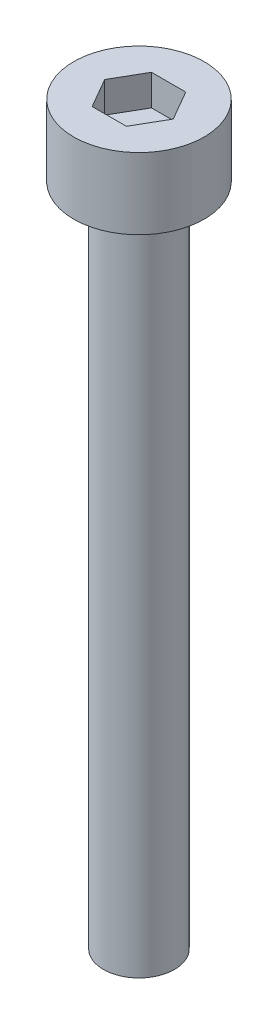
ISO-10303-21;
HEADER;
FILE_DESCRIPTION(('STEP AP214'),'2;1');
FILE_NAME('part.step','',(''),(''),'','','');
FILE_SCHEMA(('AUTOMOTIVE_DESIGN { 1 0 10303 214 1 1 1 1 }'));
ENDSEC;
DATA;
#1=APPLICATION_CONTEXT('core data for automotive mechanical design processes');
#2=APPLICATION_PROTOCOL_DEFINITION('international standard','automotive_design',2000,#1);
#3=PRODUCT_CONTEXT('',#1,'mechanical');
#4=PRODUCT('Part','Part','',(#3));
#5=PRODUCT_RELATED_PRODUCT_CATEGORY('part','',(#4));
#6=PRODUCT_DEFINITION_FORMATION('','',#4);
#7=PRODUCT_DEFINITION_CONTEXT('part definition',#1,'design');
#8=PRODUCT_DEFINITION('design','',#6,#7);
#9=PRODUCT_DEFINITION_SHAPE('','',#8);
#10=(LENGTH_UNIT() NAMED_UNIT(*) SI_UNIT(.MILLI.,.METRE.));
#11=(NAMED_UNIT(*) PLANE_ANGLE_UNIT() SI_UNIT($,.RADIAN.));
#12=(NAMED_UNIT(*) SI_UNIT($,.STERADIAN.) SOLID_ANGLE_UNIT());
#13=UNCERTAINTY_MEASURE_WITH_UNIT(LENGTH_MEASURE(1.E-05),#10,'distance_accuracy_value','');
#14=(GEOMETRIC_REPRESENTATION_CONTEXT(3) GLOBAL_UNCERTAINTY_ASSIGNED_CONTEXT((#13)) GLOBAL_UNIT_ASSIGNED_CONTEXT((#10,
#11,#12)) REPRESENTATION_CONTEXT('',''));
#15=CARTESIAN_POINT('',(0.,0.,0.));
#16=DIRECTION('',(0.,0.,1.));
#17=DIRECTION('',(1.,0.,0.));
#18=AXIS2_PLACEMENT_3D('',#15,#16,#17);
#19=CARTESIAN_POINT('',(0.,3.,0.));
#20=DIRECTION('',(0.,-1.,0.));
#21=DIRECTION('',(0.,0.,-1.));
#22=AXIS2_PLACEMENT_3D('',#19,#20,#21);
#23=CYLINDRICAL_SURFACE('',#22,2.75);
#24=CARTESIAN_POINT('',(0.,3.,0.));
#25=DIRECTION('',(0.,1.,0.));
#26=DIRECTION('',(0.,0.,1.));
#27=AXIS2_PLACEMENT_3D('',#24,#25,#26);
#28=CIRCLE('',#27,2.75);
#29=CARTESIAN_POINT('',(0.,3.,2.75));
#30=VERTEX_POINT('',#29);
#31=EDGE_CURVE('E45',#30,#30,#28,.T.);
#32=ORIENTED_EDGE('',*,*,#31,.F.);
#33=EDGE_LOOP('',(#32));
#34=FACE_BOUND('',#33,.T.);
#35=CARTESIAN_POINT('',(0.,0.,0.));
#36=DIRECTION('',(0.,1.,0.));
#37=DIRECTION('',(0.,0.,1.));
#38=AXIS2_PLACEMENT_3D('',#35,#36,#37);
#39=CIRCLE('',#38,2.75);
#40=CARTESIAN_POINT('',(0.,0.,2.75));
#41=VERTEX_POINT('',#40);
#42=EDGE_CURVE('E40',#41,#41,#39,.T.);
#43=ORIENTED_EDGE('',*,*,#42,.T.);
#44=EDGE_LOOP('',(#43));
#45=FACE_BOUND('',#44,.T.);
#46=ADVANCED_FACE('F37',(#34,#45),#23,.T.);
#47=CARTESIAN_POINT('',(0.,3.,0.));
#48=DIRECTION('',(0.,1.,0.));
#49=DIRECTION('',(0.,0.,1.));
#50=AXIS2_PLACEMENT_3D('',#47,#48,#49);
#51=PLANE('',#50);
#52=DIRECTION('',(0.5,0.,-0.866025403784439));
#53=VECTOR('',#52,1.);
#54=CARTESIAN_POINT('',(0.721687836487032,3.,1.25));
#55=LINE('',#54,#53);
#56=CARTESIAN_POINT('',(0.721687836487032,3.,1.25));
#57=VERTEX_POINT('',#56);
#58=CARTESIAN_POINT('',(1.44337567297406,3.,0.));
#59=VERTEX_POINT('',#58);
#60=EDGE_CURVE('E53',#57,#59,#55,.T.);
#61=ORIENTED_EDGE('',*,*,#60,.F.);
#62=DIRECTION('',(1.,0.,0.));
#63=VECTOR('',#62,1.);
#64=CARTESIAN_POINT('',(-0.721687836487033,3.,1.25));
#65=LINE('',#64,#63);
#66=CARTESIAN_POINT('',(-0.721687836487033,3.,1.25));
#67=VERTEX_POINT('',#66);
#68=EDGE_CURVE('E137',#67,#57,#65,.T.);
#69=ORIENTED_EDGE('',*,*,#68,.F.);
#70=DIRECTION('',(0.5,0.,0.866025403784439));
#71=VECTOR('',#70,1.);
#72=CARTESIAN_POINT('',(-1.44337567297407,3.,0.));
#73=LINE('',#72,#71);
#74=CARTESIAN_POINT('',(-1.44337567297407,3.,0.));
#75=VERTEX_POINT('',#74);
#76=EDGE_CURVE('E135',#75,#67,#73,.T.);
#77=ORIENTED_EDGE('',*,*,#76,.F.);
#78=DIRECTION('',(-0.5,0.,0.866025403784438));
#79=VECTOR('',#78,1.);
#80=CARTESIAN_POINT('',(-0.721687836487033,3.,-1.25));
#81=LINE('',#80,#79);
#82=CARTESIAN_POINT('',(-0.721687836487033,3.,-1.25));
#83=VERTEX_POINT('',#82);
#84=EDGE_CURVE('E101',#83,#75,#81,.T.);
#85=ORIENTED_EDGE('',*,*,#84,.F.);
#86=DIRECTION('',(-1.,0.,0.));
#87=VECTOR('',#86,1.);
#88=CARTESIAN_POINT('',(0.721687836487032,3.,-1.25));
#89=LINE('',#88,#87);
#90=CARTESIAN_POINT('',(0.721687836487032,3.,-1.25));
#91=VERTEX_POINT('',#90);
#92=EDGE_CURVE('E131',#91,#83,#89,.T.);
#93=ORIENTED_EDGE('',*,*,#92,.F.);
#94=DIRECTION('',(-0.5,0.,-0.866025403784439));
#95=VECTOR('',#94,1.);
#96=CARTESIAN_POINT('',(1.44337567297406,3.,0.));
#97=LINE('',#96,#95);
#98=EDGE_CURVE('E127',#59,#91,#97,.T.);
#99=ORIENTED_EDGE('',*,*,#98,.F.);
#100=EDGE_LOOP('',(#61,#69,#77,#85,#93,#99));
#101=FACE_BOUND('',#100,.T.);
#102=ORIENTED_EDGE('',*,*,#31,.T.);
#103=EDGE_LOOP('',(#102));
#104=FACE_BOUND('',#103,.T.);
#105=ADVANCED_FACE('F155',(#101,#104),#51,.T.);
#106=CARTESIAN_POINT('',(0.,0.,0.));
#107=DIRECTION('',(0.,1.,0.));
#108=DIRECTION('',(0.,0.,1.));
#109=AXIS2_PLACEMENT_3D('',#106,#107,#108);
#110=PLANE('',#109);
#111=CARTESIAN_POINT('',(0.,0.,0.));
#112=DIRECTION('',(0.,-1.,0.));
#113=DIRECTION('',(0.,0.,-1.));
#114=AXIS2_PLACEMENT_3D('',#111,#112,#113);
#115=CIRCLE('',#114,1.5);
#116=CARTESIAN_POINT('',(0.,0.,-1.5));
#117=VERTEX_POINT('',#116);
#118=EDGE_CURVE('E11',#117,#117,#115,.T.);
#119=ORIENTED_EDGE('',*,*,#118,.F.);
#120=EDGE_LOOP('',(#119));
#121=FACE_BOUND('',#120,.T.);
#122=ORIENTED_EDGE('',*,*,#42,.F.);
#123=EDGE_LOOP('',(#122));
#124=FACE_BOUND('',#123,.T.);
#125=ADVANCED_FACE('F152',(#121,#124),#110,.F.);
#126=CARTESIAN_POINT('',(0.721687836487032,1.7,1.25));
#127=DIRECTION('',(0.866025403784439,0.,0.5));
#128=DIRECTION('',(0.5,0.,-0.866025403784439));
#129=AXIS2_PLACEMENT_3D('',#126,#127,#128);
#130=PLANE('',#129);
#131=ORIENTED_EDGE('',*,*,#60,.T.);
#132=DIRECTION('',(0.,1.,0.));
#133=VECTOR('',#132,1.);
#134=CARTESIAN_POINT('',(1.44337567297406,1.7,0.));
#135=LINE('',#134,#133);
#136=CARTESIAN_POINT('',(1.44337567297406,1.7,0.));
#137=VERTEX_POINT('',#136);
#138=EDGE_CURVE('E83',#137,#59,#135,.T.);
#139=ORIENTED_EDGE('',*,*,#138,.F.);
#140=DIRECTION('',(0.5,0.,-0.866025403784439));
#141=VECTOR('',#140,1.);
#142=CARTESIAN_POINT('',(0.721687836487032,1.7,1.25));
#143=LINE('',#142,#141);
#144=CARTESIAN_POINT('',(0.721687836487032,1.7,1.25));
#145=VERTEX_POINT('',#144);
#146=EDGE_CURVE('E139',#145,#137,#143,.T.);
#147=ORIENTED_EDGE('',*,*,#146,.F.);
#148=DIRECTION('',(0.,1.,0.));
#149=VECTOR('',#148,1.);
#150=CARTESIAN_POINT('',(0.721687836487032,1.7,1.25));
#151=LINE('',#150,#149);
#152=EDGE_CURVE('E61',#145,#57,#151,.T.);
#153=ORIENTED_EDGE('',*,*,#152,.T.);
#154=EDGE_LOOP('',(#131,#139,#147,#153));
#155=FACE_BOUND('',#154,.T.);
#156=ADVANCED_FACE('F154',(#155),#130,.F.);
#157=CARTESIAN_POINT('',(-0.721687836487033,1.7,1.25));
#158=DIRECTION('',(0.,0.,1.));
#159=DIRECTION('',(1.,0.,0.));
#160=AXIS2_PLACEMENT_3D('',#157,#158,#159);
#161=PLANE('',#160);
#162=ORIENTED_EDGE('',*,*,#68,.T.);
#163=ORIENTED_EDGE('',*,*,#152,.F.);
#164=DIRECTION('',(1.,0.,0.));
#165=VECTOR('',#164,1.);
#166=CARTESIAN_POINT('',(-0.721687836487033,1.7,1.25));
#167=LINE('',#166,#165);
#168=CARTESIAN_POINT('',(-0.721687836487033,1.7,1.25));
#169=VERTEX_POINT('',#168);
#170=EDGE_CURVE('E113',#169,#145,#167,.T.);
#171=ORIENTED_EDGE('',*,*,#170,.F.);
#172=DIRECTION('',(0.,1.,0.));
#173=VECTOR('',#172,1.);
#174=CARTESIAN_POINT('',(-0.721687836487033,1.7,1.25));
#175=LINE('',#174,#173);
#176=EDGE_CURVE('E105',#169,#67,#175,.T.);
#177=ORIENTED_EDGE('',*,*,#176,.T.);
#178=EDGE_LOOP('',(#162,#163,#171,#177));
#179=FACE_BOUND('',#178,.T.);
#180=ADVANCED_FACE('F161',(#179),#161,.F.);
#181=CARTESIAN_POINT('',(-1.44337567297407,1.7,0.));
#182=DIRECTION('',(-0.866025403784439,0.,0.5));
#183=DIRECTION('',(0.5,0.,0.866025403784439));
#184=AXIS2_PLACEMENT_3D('',#181,#182,#183);
#185=PLANE('',#184);
#186=ORIENTED_EDGE('',*,*,#76,.T.);
#187=ORIENTED_EDGE('',*,*,#176,.F.);
#188=DIRECTION('',(0.5,0.,0.866025403784439));
#189=VECTOR('',#188,1.);
#190=CARTESIAN_POINT('',(-1.44337567297407,1.7,0.));
#191=LINE('',#190,#189);
#192=CARTESIAN_POINT('',(-1.44337567297407,1.7,0.));
#193=VERTEX_POINT('',#192);
#194=EDGE_CURVE('E109',#193,#169,#191,.T.);
#195=ORIENTED_EDGE('',*,*,#194,.F.);
#196=DIRECTION('',(0.,1.,0.));
#197=VECTOR('',#196,1.);
#198=CARTESIAN_POINT('',(-1.44337567297407,1.7,0.));
#199=LINE('',#198,#197);
#200=EDGE_CURVE('E94',#193,#75,#199,.T.);
#201=ORIENTED_EDGE('',*,*,#200,.T.);
#202=EDGE_LOOP('',(#186,#187,#195,#201));
#203=FACE_BOUND('',#202,.T.);
#204=ADVANCED_FACE('F110',(#203),#185,.F.);
#205=CARTESIAN_POINT('',(-0.721687836487033,1.7,-1.25));
#206=DIRECTION('',(-0.866025403784439,0.,-0.5));
#207=DIRECTION('',(-0.5,0.,0.866025403784439));
#208=AXIS2_PLACEMENT_3D('',#205,#206,#207);
#209=PLANE('',#208);
#210=ORIENTED_EDGE('',*,*,#84,.T.);
#211=ORIENTED_EDGE('',*,*,#200,.F.);
#212=DIRECTION('',(-0.5,0.,0.866025403784438));
#213=VECTOR('',#212,1.);
#214=CARTESIAN_POINT('',(-0.721687836487033,1.7,-1.25));
#215=LINE('',#214,#213);
#216=CARTESIAN_POINT('',(-0.721687836487033,1.7,-1.25));
#217=VERTEX_POINT('',#216);
#218=EDGE_CURVE('E98',#217,#193,#215,.T.);
#219=ORIENTED_EDGE('',*,*,#218,.F.);
#220=DIRECTION('',(0.,1.,0.));
#221=VECTOR('',#220,1.);
#222=CARTESIAN_POINT('',(-0.721687836487033,1.7,-1.25));
#223=LINE('',#222,#221);
#224=EDGE_CURVE('E106',#217,#83,#223,.T.);
#225=ORIENTED_EDGE('',*,*,#224,.T.);
#226=EDGE_LOOP('',(#210,#211,#219,#225));
#227=FACE_BOUND('',#226,.T.);
#228=ADVANCED_FACE('F96',(#227),#209,.F.);
#229=CARTESIAN_POINT('',(0.721687836487032,1.7,-1.25));
#230=DIRECTION('',(0.,0.,-1.));
#231=DIRECTION('',(-1.,0.,0.));
#232=AXIS2_PLACEMENT_3D('',#229,#230,#231);
#233=PLANE('',#232);
#234=ORIENTED_EDGE('',*,*,#92,.T.);
#235=ORIENTED_EDGE('',*,*,#224,.F.);
#236=DIRECTION('',(-1.,0.,0.));
#237=VECTOR('',#236,1.);
#238=CARTESIAN_POINT('',(0.721687836487032,1.7,-1.25));
#239=LINE('',#238,#237);
#240=CARTESIAN_POINT('',(0.721687836487032,1.7,-1.25));
#241=VERTEX_POINT('',#240);
#242=EDGE_CURVE('E119',#241,#217,#239,.T.);
#243=ORIENTED_EDGE('',*,*,#242,.F.);
#244=DIRECTION('',(0.,1.,0.));
#245=VECTOR('',#244,1.);
#246=CARTESIAN_POINT('',(0.721687836487032,1.7,-1.25));
#247=LINE('',#246,#245);
#248=EDGE_CURVE('E143',#241,#91,#247,.T.);
#249=ORIENTED_EDGE('',*,*,#248,.T.);
#250=EDGE_LOOP('',(#234,#235,#243,#249));
#251=FACE_BOUND('',#250,.T.);
#252=ADVANCED_FACE('F206',(#251),#233,.F.);
#253=CARTESIAN_POINT('',(1.44337567297406,1.7,0.));
#254=DIRECTION('',(0.866025403784439,0.,-0.5));
#255=DIRECTION('',(-0.5,0.,-0.866025403784439));
#256=AXIS2_PLACEMENT_3D('',#253,#254,#255);
#257=PLANE('',#256);
#258=ORIENTED_EDGE('',*,*,#98,.T.);
#259=ORIENTED_EDGE('',*,*,#248,.F.);
#260=DIRECTION('',(-0.5,0.,-0.866025403784439));
#261=VECTOR('',#260,1.);
#262=CARTESIAN_POINT('',(1.44337567297406,1.7,0.));
#263=LINE('',#262,#261);
#264=EDGE_CURVE('E121',#137,#241,#263,.T.);
#265=ORIENTED_EDGE('',*,*,#264,.F.);
#266=ORIENTED_EDGE('',*,*,#138,.T.);
#267=EDGE_LOOP('',(#258,#259,#265,#266));
#268=FACE_BOUND('',#267,.T.);
#269=ADVANCED_FACE('F215',(#268),#257,.F.);
#270=CARTESIAN_POINT('',(0.,1.7,0.));
#271=DIRECTION('',(0.,1.,0.));
#272=DIRECTION('',(0.,0.,1.));
#273=AXIS2_PLACEMENT_3D('',#270,#271,#272);
#274=PLANE('',#273);
#275=ORIENTED_EDGE('',*,*,#146,.T.);
#276=ORIENTED_EDGE('',*,*,#264,.T.);
#277=ORIENTED_EDGE('',*,*,#242,.T.);
#278=ORIENTED_EDGE('',*,*,#218,.T.);
#279=ORIENTED_EDGE('',*,*,#194,.T.);
#280=ORIENTED_EDGE('',*,*,#170,.T.);
#281=EDGE_LOOP('',(#275,#276,#277,#278,#279,#280));
#282=FACE_BOUND('',#281,.T.);
#283=ADVANCED_FACE('F116',(#282),#274,.T.);
#284=CARTESIAN_POINT('',(0.,-28.,0.));
#285=DIRECTION('',(0.,1.,0.));
#286=DIRECTION('',(0.,0.,1.));
#287=AXIS2_PLACEMENT_3D('',#284,#285,#286);
#288=CYLINDRICAL_SURFACE('',#287,1.5);
#289=CARTESIAN_POINT('',(0.,-28.,0.));
#290=DIRECTION('',(0.,-1.,0.));
#291=DIRECTION('',(0.,0.,-1.));
#292=AXIS2_PLACEMENT_3D('',#289,#290,#291);
#293=CIRCLE('',#292,1.5);
#294=CARTESIAN_POINT('',(0.,-28.,-1.5));
#295=VERTEX_POINT('',#294);
#296=EDGE_CURVE('E128',#295,#295,#293,.T.);
#297=ORIENTED_EDGE('',*,*,#296,.F.);
#298=EDGE_LOOP('',(#297));
#299=FACE_BOUND('',#298,.T.);
#300=ORIENTED_EDGE('',*,*,#118,.T.);
#301=EDGE_LOOP('',(#300));
#302=FACE_BOUND('',#301,.T.);
#303=ADVANCED_FACE('F233',(#299,#302),#288,.T.);
#304=CARTESIAN_POINT('',(0.,-28.,0.));
#305=DIRECTION('',(0.,-1.,0.));
#306=DIRECTION('',(0.,0.,-1.));
#307=AXIS2_PLACEMENT_3D('',#304,#305,#306);
#308=PLANE('',#307);
#309=ORIENTED_EDGE('',*,*,#296,.T.);
#310=EDGE_LOOP('',(#309));
#311=FACE_BOUND('',#310,.T.);
#312=ADVANCED_FACE('F247',(#311),#308,.T.);
#313=CLOSED_SHELL('',(#46,#105,#125,#156,#180,#204,#228,#252,#269,#283,#303,#312));
#314=MANIFOLD_SOLID_BREP('B2',#313);
#315=ADVANCED_BREP_SHAPE_REPRESENTATION('',(#18,#314),#14);
#316=SHAPE_DEFINITION_REPRESENTATION(#9,#315);
ENDSEC;
END-ISO-10303-21;
